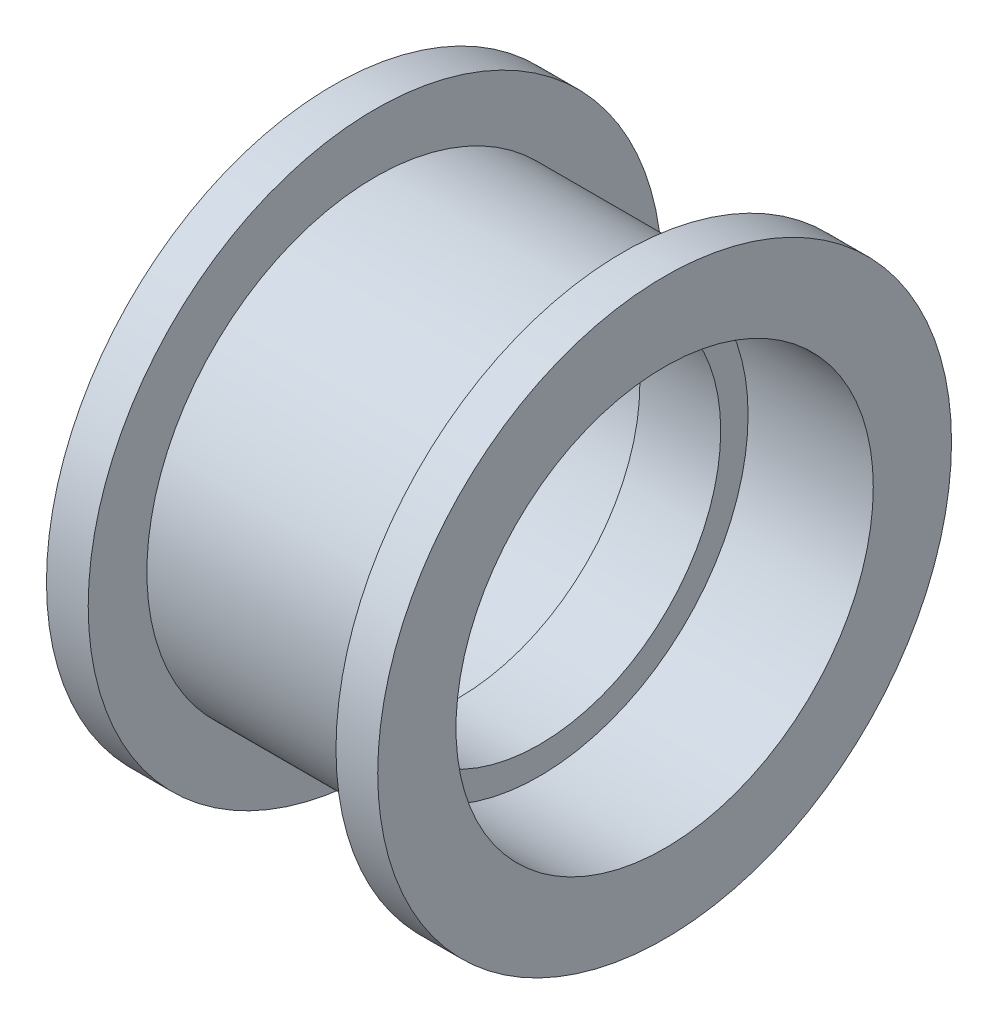
ISO-10303-21;
HEADER;
FILE_DESCRIPTION(('STEP AP214'),'2;1');
FILE_NAME('part.step','',(''),(''),'','','');
FILE_SCHEMA(('AUTOMOTIVE_DESIGN { 1 0 10303 214 1 1 1 1 }'));
ENDSEC;
DATA;
#1=APPLICATION_CONTEXT('core data for automotive mechanical design processes');
#2=APPLICATION_PROTOCOL_DEFINITION('international standard','automotive_design',2000,#1);
#3=PRODUCT_CONTEXT('',#1,'mechanical');
#4=PRODUCT('Part','Part','',(#3));
#5=PRODUCT_RELATED_PRODUCT_CATEGORY('part','',(#4));
#6=PRODUCT_DEFINITION_FORMATION('','',#4);
#7=PRODUCT_DEFINITION_CONTEXT('part definition',#1,'design');
#8=PRODUCT_DEFINITION('design','',#6,#7);
#9=PRODUCT_DEFINITION_SHAPE('','',#8);
#10=(LENGTH_UNIT() NAMED_UNIT(*) SI_UNIT(.MILLI.,.METRE.));
#11=(NAMED_UNIT(*) PLANE_ANGLE_UNIT() SI_UNIT($,.RADIAN.));
#12=(NAMED_UNIT(*) SI_UNIT($,.STERADIAN.) SOLID_ANGLE_UNIT());
#13=UNCERTAINTY_MEASURE_WITH_UNIT(LENGTH_MEASURE(1.E-05),#10,'distance_accuracy_value','');
#14=(GEOMETRIC_REPRESENTATION_CONTEXT(3) GLOBAL_UNCERTAINTY_ASSIGNED_CONTEXT((#13)) GLOBAL_UNIT_ASSIGNED_CONTEXT((#10,
#11,#12)) REPRESENTATION_CONTEXT('',''));
#15=CARTESIAN_POINT('',(0.,0.,0.));
#16=DIRECTION('',(0.,0.,1.));
#17=DIRECTION('',(1.,0.,0.));
#18=AXIS2_PLACEMENT_3D('',#15,#16,#17);
#19=CARTESIAN_POINT('',(-1.55,6.95,0.));
#20=DIRECTION('',(-1.,0.,0.));
#21=DIRECTION('',(0.,0.,1.));
#22=AXIS2_PLACEMENT_3D('',#19,#20,#21);
#23=PLANE('',#22);
#24=CARTESIAN_POINT('',(-1.55,0.,0.));
#25=DIRECTION('',(1.,0.,0.));
#26=DIRECTION('',(0.,0.,-1.));
#27=AXIS2_PLACEMENT_3D('',#24,#25,#26);
#28=CIRCLE('',#27,6.95);
#29=CARTESIAN_POINT('',(-1.55,0.,-6.95));
#30=VERTEX_POINT('',#29);
#31=EDGE_CURVE('E10',#30,#30,#28,.T.);
#32=ORIENTED_EDGE('',*,*,#31,.T.);
#33=EDGE_LOOP('',(#32));
#34=FACE_BOUND('',#33,.T.);
#35=CARTESIAN_POINT('',(-1.55,0.,0.));
#36=DIRECTION('',(1.,0.,0.));
#37=DIRECTION('',(0.,0.,-1.));
#38=AXIS2_PLACEMENT_3D('',#35,#36,#37);
#39=CIRCLE('',#38,8.);
#40=CARTESIAN_POINT('',(-1.55,0.,-8.));
#41=VERTEX_POINT('',#40);
#42=EDGE_CURVE('E72',#41,#41,#39,.T.);
#43=ORIENTED_EDGE('',*,*,#42,.F.);
#44=EDGE_LOOP('',(#43));
#45=FACE_BOUND('',#44,.T.);
#46=ADVANCED_FACE('F32',(#34,#45),#23,.T.);
#47=CARTESIAN_POINT('',(0.,0.,0.));
#48=DIRECTION('',(1.,0.,0.));
#49=DIRECTION('',(0.,0.,-1.));
#50=AXIS2_PLACEMENT_3D('',#47,#48,#49);
#51=CYLINDRICAL_SURFACE('',#50,6.95);
#52=CARTESIAN_POINT('',(1.55,0.,0.));
#53=DIRECTION('',(1.,0.,0.));
#54=DIRECTION('',(0.,0.,-1.));
#55=AXIS2_PLACEMENT_3D('',#52,#53,#54);
#56=CIRCLE('',#55,6.95);
#57=CARTESIAN_POINT('',(1.55,0.,-6.95));
#58=VERTEX_POINT('',#57);
#59=EDGE_CURVE('E38',#58,#58,#56,.T.);
#60=ORIENTED_EDGE('',*,*,#59,.T.);
#61=EDGE_LOOP('',(#60));
#62=FACE_BOUND('',#61,.T.);
#63=ORIENTED_EDGE('',*,*,#31,.F.);
#64=EDGE_LOOP('',(#63));
#65=FACE_BOUND('',#64,.T.);
#66=ADVANCED_FACE('F80',(#62,#65),#51,.F.);
#67=CARTESIAN_POINT('',(1.55,6.95,0.));
#68=DIRECTION('',(1.,0.,0.));
#69=DIRECTION('',(0.,0.,-1.));
#70=AXIS2_PLACEMENT_3D('',#67,#68,#69);
#71=PLANE('',#70);
#72=CARTESIAN_POINT('',(1.55,0.,0.));
#73=DIRECTION('',(1.,0.,0.));
#74=DIRECTION('',(0.,0.,-1.));
#75=AXIS2_PLACEMENT_3D('',#72,#73,#74);
#76=CIRCLE('',#75,8.);
#77=CARTESIAN_POINT('',(1.55,0.,-8.));
#78=VERTEX_POINT('',#77);
#79=EDGE_CURVE('E42',#78,#78,#76,.T.);
#80=ORIENTED_EDGE('',*,*,#79,.T.);
#81=EDGE_LOOP('',(#80));
#82=FACE_BOUND('',#81,.T.);
#83=ORIENTED_EDGE('',*,*,#59,.F.);
#84=EDGE_LOOP('',(#83));
#85=FACE_BOUND('',#84,.T.);
#86=ADVANCED_FACE('F84',(#82,#85),#71,.T.);
#87=CARTESIAN_POINT('',(0.,0.,0.));
#88=DIRECTION('',(1.,0.,0.));
#89=DIRECTION('',(0.,0.,-1.));
#90=AXIS2_PLACEMENT_3D('',#87,#88,#89);
#91=CYLINDRICAL_SURFACE('',#90,8.);
#92=CARTESIAN_POINT('',(6.35,0.,0.));
#93=DIRECTION('',(1.,0.,0.));
#94=DIRECTION('',(0.,0.,-1.));
#95=AXIS2_PLACEMENT_3D('',#92,#93,#94);
#96=CIRCLE('',#95,8.);
#97=CARTESIAN_POINT('',(6.35,0.,-8.));
#98=VERTEX_POINT('',#97);
#99=EDGE_CURVE('E46',#98,#98,#96,.T.);
#100=ORIENTED_EDGE('',*,*,#99,.T.);
#101=EDGE_LOOP('',(#100));
#102=FACE_BOUND('',#101,.T.);
#103=ORIENTED_EDGE('',*,*,#79,.F.);
#104=EDGE_LOOP('',(#103));
#105=FACE_BOUND('',#104,.T.);
#106=ADVANCED_FACE('F88',(#102,#105),#91,.F.);
#107=CARTESIAN_POINT('',(6.35,8.,0.));
#108=DIRECTION('',(1.,0.,0.));
#109=DIRECTION('',(0.,0.,-1.));
#110=AXIS2_PLACEMENT_3D('',#107,#108,#109);
#111=PLANE('',#110);
#112=CARTESIAN_POINT('',(6.35,0.,0.));
#113=DIRECTION('',(1.,0.,0.));
#114=DIRECTION('',(0.,0.,-1.));
#115=AXIS2_PLACEMENT_3D('',#112,#113,#114);
#116=CIRCLE('',#115,11.);
#117=CARTESIAN_POINT('',(6.35,0.,-11.));
#118=VERTEX_POINT('',#117);
#119=EDGE_CURVE('E51',#118,#118,#116,.T.);
#120=ORIENTED_EDGE('',*,*,#119,.T.);
#121=EDGE_LOOP('',(#120));
#122=FACE_BOUND('',#121,.T.);
#123=ORIENTED_EDGE('',*,*,#99,.F.);
#124=EDGE_LOOP('',(#123));
#125=FACE_BOUND('',#124,.T.);
#126=ADVANCED_FACE('F95',(#122,#125),#111,.T.);
#127=CARTESIAN_POINT('',(0.,0.,0.));
#128=DIRECTION('',(1.,0.,0.));
#129=DIRECTION('',(0.,0.,-1.));
#130=AXIS2_PLACEMENT_3D('',#127,#128,#129);
#131=CYLINDRICAL_SURFACE('',#130,11.);
#132=CARTESIAN_POINT('',(4.75,0.,0.));
#133=DIRECTION('',(1.,0.,0.));
#134=DIRECTION('',(0.,0.,-1.));
#135=AXIS2_PLACEMENT_3D('',#132,#133,#134);
#136=CIRCLE('',#135,11.);
#137=CARTESIAN_POINT('',(4.75,0.,-11.));
#138=VERTEX_POINT('',#137);
#139=EDGE_CURVE('E54',#138,#138,#136,.T.);
#140=ORIENTED_EDGE('',*,*,#139,.T.);
#141=EDGE_LOOP('',(#140));
#142=FACE_BOUND('',#141,.T.);
#143=ORIENTED_EDGE('',*,*,#119,.F.);
#144=EDGE_LOOP('',(#143));
#145=FACE_BOUND('',#144,.T.);
#146=ADVANCED_FACE('F99',(#142,#145),#131,.T.);
#147=CARTESIAN_POINT('',(4.75,11.,0.));
#148=DIRECTION('',(-1.,0.,0.));
#149=DIRECTION('',(0.,0.,1.));
#150=AXIS2_PLACEMENT_3D('',#147,#148,#149);
#151=PLANE('',#150);
#152=CARTESIAN_POINT('',(4.75,0.,0.));
#153=DIRECTION('',(1.,0.,0.));
#154=DIRECTION('',(0.,0.,-1.));
#155=AXIS2_PLACEMENT_3D('',#152,#153,#154);
#156=CIRCLE('',#155,8.75);
#157=CARTESIAN_POINT('',(4.75,0.,-8.75));
#158=VERTEX_POINT('',#157);
#159=EDGE_CURVE('E57',#158,#158,#156,.T.);
#160=ORIENTED_EDGE('',*,*,#159,.T.);
#161=EDGE_LOOP('',(#160));
#162=FACE_BOUND('',#161,.T.);
#163=ORIENTED_EDGE('',*,*,#139,.F.);
#164=EDGE_LOOP('',(#163));
#165=FACE_BOUND('',#164,.T.);
#166=ADVANCED_FACE('F103',(#162,#165),#151,.T.);
#167=CARTESIAN_POINT('',(0.,0.,0.));
#168=DIRECTION('',(1.,0.,0.));
#169=DIRECTION('',(0.,0.,-1.));
#170=AXIS2_PLACEMENT_3D('',#167,#168,#169);
#171=CYLINDRICAL_SURFACE('',#170,8.75);
#172=CARTESIAN_POINT('',(-4.75,0.,0.));
#173=DIRECTION('',(1.,0.,0.));
#174=DIRECTION('',(0.,0.,-1.));
#175=AXIS2_PLACEMENT_3D('',#172,#173,#174);
#176=CIRCLE('',#175,8.75);
#177=CARTESIAN_POINT('',(-4.75,0.,-8.75));
#178=VERTEX_POINT('',#177);
#179=EDGE_CURVE('E60',#178,#178,#176,.T.);
#180=ORIENTED_EDGE('',*,*,#179,.T.);
#181=EDGE_LOOP('',(#180));
#182=FACE_BOUND('',#181,.T.);
#183=ORIENTED_EDGE('',*,*,#159,.F.);
#184=EDGE_LOOP('',(#183));
#185=FACE_BOUND('',#184,.T.);
#186=ADVANCED_FACE('F107',(#182,#185),#171,.T.);
#187=CARTESIAN_POINT('',(-4.75,11.,0.));
#188=DIRECTION('',(1.,0.,0.));
#189=DIRECTION('',(0.,0.,-1.));
#190=AXIS2_PLACEMENT_3D('',#187,#188,#189);
#191=PLANE('',#190);
#192=CARTESIAN_POINT('',(-4.75,0.,0.));
#193=DIRECTION('',(1.,0.,0.));
#194=DIRECTION('',(0.,0.,-1.));
#195=AXIS2_PLACEMENT_3D('',#192,#193,#194);
#196=CIRCLE('',#195,11.);
#197=CARTESIAN_POINT('',(-4.75,0.,-11.));
#198=VERTEX_POINT('',#197);
#199=EDGE_CURVE('E63',#198,#198,#196,.T.);
#200=ORIENTED_EDGE('',*,*,#199,.T.);
#201=EDGE_LOOP('',(#200));
#202=FACE_BOUND('',#201,.T.);
#203=ORIENTED_EDGE('',*,*,#179,.F.);
#204=EDGE_LOOP('',(#203));
#205=FACE_BOUND('',#204,.T.);
#206=ADVANCED_FACE('F111',(#202,#205),#191,.T.);
#207=CARTESIAN_POINT('',(0.,0.,0.));
#208=DIRECTION('',(1.,0.,0.));
#209=DIRECTION('',(0.,0.,-1.));
#210=AXIS2_PLACEMENT_3D('',#207,#208,#209);
#211=CYLINDRICAL_SURFACE('',#210,11.);
#212=CARTESIAN_POINT('',(-6.35,0.,0.));
#213=DIRECTION('',(1.,0.,0.));
#214=DIRECTION('',(0.,0.,-1.));
#215=AXIS2_PLACEMENT_3D('',#212,#213,#214);
#216=CIRCLE('',#215,11.);
#217=CARTESIAN_POINT('',(-6.35,0.,-11.));
#218=VERTEX_POINT('',#217);
#219=EDGE_CURVE('E66',#218,#218,#216,.T.);
#220=ORIENTED_EDGE('',*,*,#219,.T.);
#221=EDGE_LOOP('',(#220));
#222=FACE_BOUND('',#221,.T.);
#223=ORIENTED_EDGE('',*,*,#199,.F.);
#224=EDGE_LOOP('',(#223));
#225=FACE_BOUND('',#224,.T.);
#226=ADVANCED_FACE('F115',(#222,#225),#211,.T.);
#227=CARTESIAN_POINT('',(-6.35,8.,0.));
#228=DIRECTION('',(-1.,0.,0.));
#229=DIRECTION('',(0.,0.,1.));
#230=AXIS2_PLACEMENT_3D('',#227,#228,#229);
#231=PLANE('',#230);
#232=CARTESIAN_POINT('',(-6.35,0.,0.));
#233=DIRECTION('',(1.,0.,0.));
#234=DIRECTION('',(0.,0.,-1.));
#235=AXIS2_PLACEMENT_3D('',#232,#233,#234);
#236=CIRCLE('',#235,8.);
#237=CARTESIAN_POINT('',(-6.35,0.,-8.));
#238=VERTEX_POINT('',#237);
#239=EDGE_CURVE('E69',#238,#238,#236,.T.);
#240=ORIENTED_EDGE('',*,*,#239,.T.);
#241=EDGE_LOOP('',(#240));
#242=FACE_BOUND('',#241,.T.);
#243=ORIENTED_EDGE('',*,*,#219,.F.);
#244=EDGE_LOOP('',(#243));
#245=FACE_BOUND('',#244,.T.);
#246=ADVANCED_FACE('F119',(#242,#245),#231,.T.);
#247=CARTESIAN_POINT('',(0.,0.,0.));
#248=DIRECTION('',(1.,0.,0.));
#249=DIRECTION('',(0.,0.,-1.));
#250=AXIS2_PLACEMENT_3D('',#247,#248,#249);
#251=CYLINDRICAL_SURFACE('',#250,8.);
#252=ORIENTED_EDGE('',*,*,#42,.T.);
#253=EDGE_LOOP('',(#252));
#254=FACE_BOUND('',#253,.T.);
#255=ORIENTED_EDGE('',*,*,#239,.F.);
#256=EDGE_LOOP('',(#255));
#257=FACE_BOUND('',#256,.T.);
#258=ADVANCED_FACE('F76',(#254,#257),#251,.F.);
#259=CLOSED_SHELL('',(#46,#66,#86,#106,#126,#146,#166,#186,#206,#226,#246,#258));
#260=MANIFOLD_SOLID_BREP('B2',#259);
#261=ADVANCED_BREP_SHAPE_REPRESENTATION('',(#18,#260),#14);
#262=SHAPE_DEFINITION_REPRESENTATION(#9,#261);
ENDSEC;
END-ISO-10303-21;
